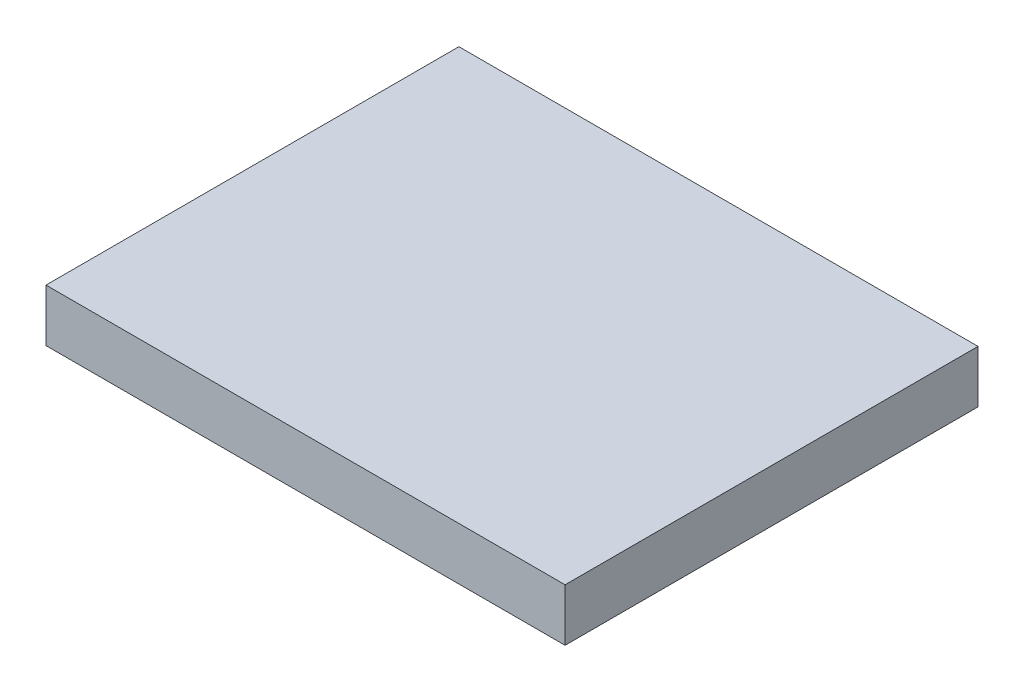
ISO-10303-21;
HEADER;
FILE_DESCRIPTION(('STEP AP214'),'2;1');
FILE_NAME('part.step','',(''),(''),'','','');
FILE_SCHEMA(('AUTOMOTIVE_DESIGN { 1 0 10303 214 1 1 1 1 }'));
ENDSEC;
DATA;
#1=APPLICATION_CONTEXT('core data for automotive mechanical design processes');
#2=APPLICATION_PROTOCOL_DEFINITION('international standard','automotive_design',2000,#1);
#3=PRODUCT_CONTEXT('',#1,'mechanical');
#4=PRODUCT('Part','Part','',(#3));
#5=PRODUCT_RELATED_PRODUCT_CATEGORY('part','',(#4));
#6=PRODUCT_DEFINITION_FORMATION('','',#4);
#7=PRODUCT_DEFINITION_CONTEXT('part definition',#1,'design');
#8=PRODUCT_DEFINITION('design','',#6,#7);
#9=PRODUCT_DEFINITION_SHAPE('','',#8);
#10=(LENGTH_UNIT() NAMED_UNIT(*) SI_UNIT(.MILLI.,.METRE.));
#11=(NAMED_UNIT(*) PLANE_ANGLE_UNIT() SI_UNIT($,.RADIAN.));
#12=(NAMED_UNIT(*) SI_UNIT($,.STERADIAN.) SOLID_ANGLE_UNIT());
#13=UNCERTAINTY_MEASURE_WITH_UNIT(LENGTH_MEASURE(1.E-05),#10,'distance_accuracy_value','');
#14=(GEOMETRIC_REPRESENTATION_CONTEXT(3) GLOBAL_UNCERTAINTY_ASSIGNED_CONTEXT((#13)) GLOBAL_UNIT_ASSIGNED_CONTEXT((#10,
#11,#12)) REPRESENTATION_CONTEXT('',''));
#15=CARTESIAN_POINT('',(0.,0.,0.));
#16=DIRECTION('',(0.,0.,1.));
#17=DIRECTION('',(1.,0.,0.));
#18=AXIS2_PLACEMENT_3D('',#15,#16,#17);
#19=CARTESIAN_POINT('',(220.,44.45,175.));
#20=DIRECTION('',(-1.,0.,0.));
#21=DIRECTION('',(0.,0.,1.));
#22=AXIS2_PLACEMENT_3D('',#19,#20,#21);
#23=PLANE('',#22);
#24=DIRECTION('',(0.,0.,-1.));
#25=VECTOR('',#24,1.);
#26=CARTESIAN_POINT('',(220.,0.,175.));
#27=LINE('',#26,#25);
#28=CARTESIAN_POINT('',(220.,0.,175.));
#29=VERTEX_POINT('',#28);
#30=CARTESIAN_POINT('',(220.,0.,-175.));
#31=VERTEX_POINT('',#30);
#32=EDGE_CURVE('E95',#29,#31,#27,.T.);
#33=ORIENTED_EDGE('',*,*,#32,.T.);
#34=DIRECTION('',(0.,-1.,0.));
#35=VECTOR('',#34,1.);
#36=CARTESIAN_POINT('',(220.,44.45,-175.));
#37=LINE('',#36,#35);
#38=CARTESIAN_POINT('',(220.,44.45,-175.));
#39=VERTEX_POINT('',#38);
#40=EDGE_CURVE('E11',#39,#31,#37,.T.);
#41=ORIENTED_EDGE('',*,*,#40,.F.);
#42=DIRECTION('',(0.,0.,-1.));
#43=VECTOR('',#42,1.);
#44=CARTESIAN_POINT('',(220.,44.45,175.));
#45=LINE('',#44,#43);
#46=CARTESIAN_POINT('',(220.,44.45,175.));
#47=VERTEX_POINT('',#46);
#48=EDGE_CURVE('E83',#47,#39,#45,.T.);
#49=ORIENTED_EDGE('',*,*,#48,.F.);
#50=DIRECTION('',(0.,-1.,0.));
#51=VECTOR('',#50,1.);
#52=CARTESIAN_POINT('',(220.,44.45,175.));
#53=LINE('',#52,#51);
#54=EDGE_CURVE('E91',#47,#29,#53,.T.);
#55=ORIENTED_EDGE('',*,*,#54,.T.);
#56=EDGE_LOOP('',(#33,#41,#49,#55));
#57=FACE_BOUND('',#56,.T.);
#58=ADVANCED_FACE('F32',(#57),#23,.F.);
#59=CARTESIAN_POINT('',(-220.,44.45,-175.));
#60=DIRECTION('',(0.,0.,1.));
#61=DIRECTION('',(1.,0.,0.));
#62=AXIS2_PLACEMENT_3D('',#59,#60,#61);
#63=PLANE('',#62);
#64=DIRECTION('',(-1.,0.,0.));
#65=VECTOR('',#64,1.);
#66=CARTESIAN_POINT('',(-220.,0.,-175.));
#67=LINE('',#66,#65);
#68=CARTESIAN_POINT('',(-220.,0.,-175.));
#69=VERTEX_POINT('',#68);
#70=EDGE_CURVE('E87',#31,#69,#67,.T.);
#71=ORIENTED_EDGE('',*,*,#70,.T.);
#72=DIRECTION('',(0.,-1.,0.));
#73=VECTOR('',#72,1.);
#74=CARTESIAN_POINT('',(-220.,44.45,-175.));
#75=LINE('',#74,#73);
#76=CARTESIAN_POINT('',(-220.,44.45,-175.));
#77=VERTEX_POINT('',#76);
#78=EDGE_CURVE('E40',#77,#69,#75,.T.);
#79=ORIENTED_EDGE('',*,*,#78,.F.);
#80=DIRECTION('',(-1.,0.,0.));
#81=VECTOR('',#80,1.);
#82=CARTESIAN_POINT('',(-220.,44.45,-175.));
#83=LINE('',#82,#81);
#84=EDGE_CURVE('E78',#39,#77,#83,.T.);
#85=ORIENTED_EDGE('',*,*,#84,.F.);
#86=ORIENTED_EDGE('',*,*,#40,.T.);
#87=EDGE_LOOP('',(#71,#79,#85,#86));
#88=FACE_BOUND('',#87,.T.);
#89=ADVANCED_FACE('F86',(#88),#63,.F.);
#90=CARTESIAN_POINT('',(-220.,44.45,175.));
#91=DIRECTION('',(1.,0.,0.));
#92=DIRECTION('',(0.,0.,-1.));
#93=AXIS2_PLACEMENT_3D('',#90,#91,#92);
#94=PLANE('',#93);
#95=DIRECTION('',(0.,0.,1.));
#96=VECTOR('',#95,1.);
#97=CARTESIAN_POINT('',(-220.,0.,175.));
#98=LINE('',#97,#96);
#99=CARTESIAN_POINT('',(-220.,0.,175.));
#100=VERTEX_POINT('',#99);
#101=EDGE_CURVE('E65',#69,#100,#98,.T.);
#102=ORIENTED_EDGE('',*,*,#101,.T.);
#103=DIRECTION('',(0.,-1.,0.));
#104=VECTOR('',#103,1.);
#105=CARTESIAN_POINT('',(-220.,44.45,175.));
#106=LINE('',#105,#104);
#107=CARTESIAN_POINT('',(-220.,44.45,175.));
#108=VERTEX_POINT('',#107);
#109=EDGE_CURVE('E88',#108,#100,#106,.T.);
#110=ORIENTED_EDGE('',*,*,#109,.F.);
#111=DIRECTION('',(0.,0.,1.));
#112=VECTOR('',#111,1.);
#113=CARTESIAN_POINT('',(-220.,44.45,175.));
#114=LINE('',#113,#112);
#115=EDGE_CURVE('E81',#77,#108,#114,.T.);
#116=ORIENTED_EDGE('',*,*,#115,.F.);
#117=ORIENTED_EDGE('',*,*,#78,.T.);
#118=EDGE_LOOP('',(#102,#110,#116,#117));
#119=FACE_BOUND('',#118,.T.);
#120=ADVANCED_FACE('F89',(#119),#94,.F.);
#121=CARTESIAN_POINT('',(-220.,44.45,175.));
#122=DIRECTION('',(0.,0.,-1.));
#123=DIRECTION('',(-1.,0.,0.));
#124=AXIS2_PLACEMENT_3D('',#121,#122,#123);
#125=PLANE('',#124);
#126=DIRECTION('',(1.,0.,0.));
#127=VECTOR('',#126,1.);
#128=CARTESIAN_POINT('',(-220.,0.,175.));
#129=LINE('',#128,#127);
#130=EDGE_CURVE('E71',#100,#29,#129,.T.);
#131=ORIENTED_EDGE('',*,*,#130,.T.);
#132=ORIENTED_EDGE('',*,*,#54,.F.);
#133=DIRECTION('',(1.,0.,0.));
#134=VECTOR('',#133,1.);
#135=CARTESIAN_POINT('',(-220.,44.45,175.));
#136=LINE('',#135,#134);
#137=EDGE_CURVE('E48',#108,#47,#136,.T.);
#138=ORIENTED_EDGE('',*,*,#137,.F.);
#139=ORIENTED_EDGE('',*,*,#109,.T.);
#140=EDGE_LOOP('',(#131,#132,#138,#139));
#141=FACE_BOUND('',#140,.T.);
#142=ADVANCED_FACE('F102',(#141),#125,.F.);
#143=CARTESIAN_POINT('',(0.,44.45,0.));
#144=DIRECTION('',(0.,-1.,0.));
#145=DIRECTION('',(0.,0.,-1.));
#146=AXIS2_PLACEMENT_3D('',#143,#144,#145);
#147=PLANE('',#146);
#148=ORIENTED_EDGE('',*,*,#48,.T.);
#149=ORIENTED_EDGE('',*,*,#84,.T.);
#150=ORIENTED_EDGE('',*,*,#115,.T.);
#151=ORIENTED_EDGE('',*,*,#137,.T.);
#152=EDGE_LOOP('',(#148,#149,#150,#151));
#153=FACE_BOUND('',#152,.T.);
#154=ADVANCED_FACE('F79',(#153),#147,.F.);
#155=CARTESIAN_POINT('',(0.,0.,0.));
#156=DIRECTION('',(0.,-1.,0.));
#157=DIRECTION('',(0.,0.,-1.));
#158=AXIS2_PLACEMENT_3D('',#155,#156,#157);
#159=PLANE('',#158);
#160=ORIENTED_EDGE('',*,*,#32,.F.);
#161=ORIENTED_EDGE('',*,*,#130,.F.);
#162=ORIENTED_EDGE('',*,*,#101,.F.);
#163=ORIENTED_EDGE('',*,*,#70,.F.);
#164=EDGE_LOOP('',(#160,#161,#162,#163));
#165=FACE_BOUND('',#164,.T.);
#166=ADVANCED_FACE('F105',(#165),#159,.T.);
#167=CLOSED_SHELL('',(#58,#89,#120,#142,#154,#166));
#168=MANIFOLD_SOLID_BREP('B2',#167);
#169=ADVANCED_BREP_SHAPE_REPRESENTATION('',(#18,#168),#14);
#170=SHAPE_DEFINITION_REPRESENTATION(#9,#169);
ENDSEC;
END-ISO-10303-21;
